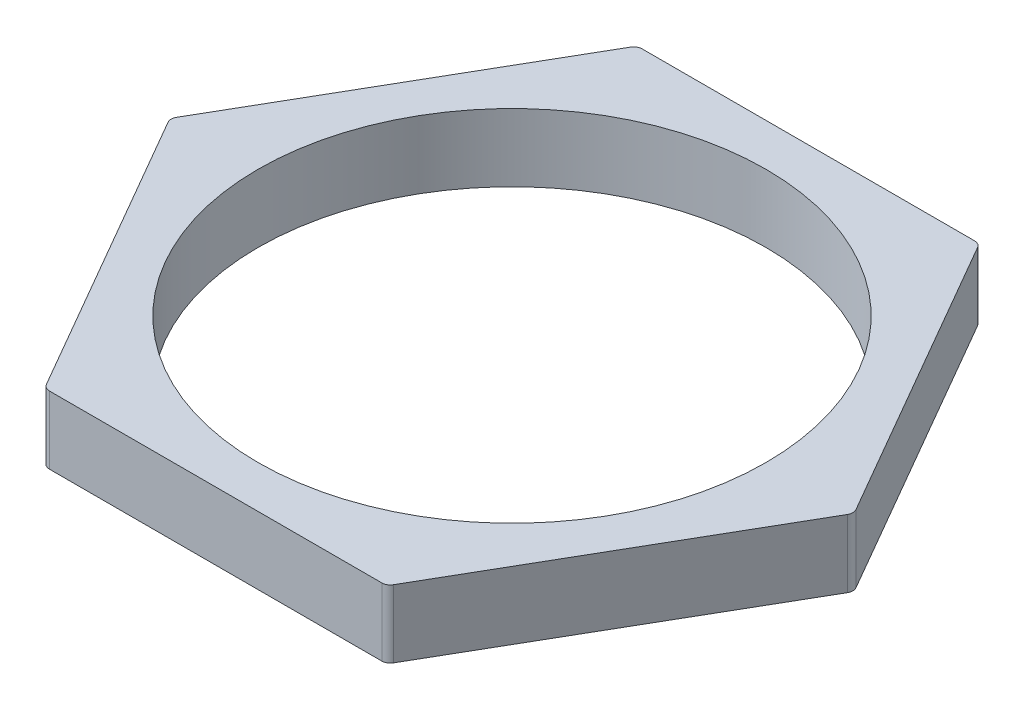
ISO-10303-21;
HEADER;
FILE_DESCRIPTION(('STEP AP214'),'2;1');
FILE_NAME('part.step','',(''),(''),'','','');
FILE_SCHEMA(('AUTOMOTIVE_DESIGN { 1 0 10303 214 1 1 1 1 }'));
ENDSEC;
DATA;
#1=APPLICATION_CONTEXT('core data for automotive mechanical design processes');
#2=APPLICATION_PROTOCOL_DEFINITION('international standard','automotive_design',2000,#1);
#3=PRODUCT_CONTEXT('',#1,'mechanical');
#4=PRODUCT('Part','Part','',(#3));
#5=PRODUCT_RELATED_PRODUCT_CATEGORY('part','',(#4));
#6=PRODUCT_DEFINITION_FORMATION('','',#4);
#7=PRODUCT_DEFINITION_CONTEXT('part definition',#1,'design');
#8=PRODUCT_DEFINITION('design','',#6,#7);
#9=PRODUCT_DEFINITION_SHAPE('','',#8);
#10=(LENGTH_UNIT() NAMED_UNIT(*) SI_UNIT(.MILLI.,.METRE.));
#11=(NAMED_UNIT(*) PLANE_ANGLE_UNIT() SI_UNIT($,.RADIAN.));
#12=(NAMED_UNIT(*) SI_UNIT($,.STERADIAN.) SOLID_ANGLE_UNIT());
#13=UNCERTAINTY_MEASURE_WITH_UNIT(LENGTH_MEASURE(1.E-05),#10,'distance_accuracy_value','');
#14=(GEOMETRIC_REPRESENTATION_CONTEXT(3) GLOBAL_UNCERTAINTY_ASSIGNED_CONTEXT((#13)) GLOBAL_UNIT_ASSIGNED_CONTEXT((#10,
#11,#12)) REPRESENTATION_CONTEXT('',''));
#15=CARTESIAN_POINT('',(0.,0.,0.));
#16=DIRECTION('',(0.,0.,1.));
#17=DIRECTION('',(1.,0.,0.));
#18=AXIS2_PLACEMENT_3D('',#15,#16,#17);
#19=CARTESIAN_POINT('',(9.81495457622365,4.,17.));
#20=DIRECTION('',(0.,-1.,0.));
#21=DIRECTION('',(0.,0.,-1.));
#22=AXIS2_PLACEMENT_3D('',#19,#20,#21);
#23=CYLINDRICAL_SURFACE('',#22,0.5);
#24=CARTESIAN_POINT('',(9.81495457622365,0.,17.));
#25=DIRECTION('',(0.,-1.,0.));
#26=DIRECTION('',(0.,0.,-1.));
#27=AXIS2_PLACEMENT_3D('',#24,#25,#26);
#28=CIRCLE('',#27,0.5);
#29=CARTESIAN_POINT('',(9.81495457622365,0.,17.5));
#30=VERTEX_POINT('',#29);
#31=CARTESIAN_POINT('',(10.2479672781159,0.,17.25));
#32=VERTEX_POINT('',#31);
#33=EDGE_CURVE('E20',#30,#32,#28,.F.);
#34=ORIENTED_EDGE('',*,*,#33,.T.);
#35=DIRECTION('',(0.,1.,0.));
#36=VECTOR('',#35,1.);
#37=CARTESIAN_POINT('',(10.2479672781159,4.,17.25));
#38=LINE('',#37,#36);
#39=CARTESIAN_POINT('',(10.2479672781159,4.,17.25));
#40=VERTEX_POINT('',#39);
#41=EDGE_CURVE('E76',#32,#40,#38,.T.);
#42=ORIENTED_EDGE('',*,*,#41,.T.);
#43=CARTESIAN_POINT('',(9.81495457622365,4.,17.));
#44=DIRECTION('',(0.,-1.,0.));
#45=DIRECTION('',(0.,0.,-1.));
#46=AXIS2_PLACEMENT_3D('',#43,#44,#45);
#47=CIRCLE('',#46,0.5);
#48=CARTESIAN_POINT('',(9.81495457622365,4.,17.5));
#49=VERTEX_POINT('',#48);
#50=EDGE_CURVE('E158',#49,#40,#47,.F.);
#51=ORIENTED_EDGE('',*,*,#50,.F.);
#52=DIRECTION('',(0.,1.,0.));
#53=VECTOR('',#52,1.);
#54=CARTESIAN_POINT('',(9.81495457622365,4.,17.5));
#55=LINE('',#54,#53);
#56=EDGE_CURVE('E78',#49,#30,#55,.F.);
#57=ORIENTED_EDGE('',*,*,#56,.T.);
#58=EDGE_LOOP('',(#34,#42,#51,#57));
#59=FACE_BOUND('',#58,.T.);
#60=ADVANCED_FACE('F17',(#59),#23,.T.);
#61=CARTESIAN_POINT('',(19.6299091524473,4.,0.));
#62=DIRECTION('',(0.,-1.,0.));
#63=DIRECTION('',(0.,0.,-1.));
#64=AXIS2_PLACEMENT_3D('',#61,#62,#63);
#65=CYLINDRICAL_SURFACE('',#64,0.5);
#66=CARTESIAN_POINT('',(19.6299091524473,0.,0.));
#67=DIRECTION('',(0.,-1.,0.));
#68=DIRECTION('',(0.,0.,-1.));
#69=AXIS2_PLACEMENT_3D('',#66,#67,#68);
#70=CIRCLE('',#69,0.5);
#71=CARTESIAN_POINT('',(20.0629218543395,0.,0.249999999999997));
#72=VERTEX_POINT('',#71);
#73=CARTESIAN_POINT('',(20.0629218543395,0.,-0.250000000000002));
#74=VERTEX_POINT('',#73);
#75=EDGE_CURVE('E80',#72,#74,#70,.F.);
#76=ORIENTED_EDGE('',*,*,#75,.T.);
#77=DIRECTION('',(0.,1.,0.));
#78=VECTOR('',#77,1.);
#79=CARTESIAN_POINT('',(20.0629218543395,4.,-0.250000000000004));
#80=LINE('',#79,#78);
#81=CARTESIAN_POINT('',(20.0629218543395,4.,-0.250000000000003));
#82=VERTEX_POINT('',#81);
#83=EDGE_CURVE('E124',#74,#82,#80,.T.);
#84=ORIENTED_EDGE('',*,*,#83,.T.);
#85=CARTESIAN_POINT('',(19.6299091524473,4.,0.));
#86=DIRECTION('',(0.,-1.,0.));
#87=DIRECTION('',(0.,0.,-1.));
#88=AXIS2_PLACEMENT_3D('',#85,#86,#87);
#89=CIRCLE('',#88,0.5);
#90=CARTESIAN_POINT('',(20.0629218543395,4.,0.249999999999997));
#91=VERTEX_POINT('',#90);
#92=EDGE_CURVE('E155',#91,#82,#89,.F.);
#93=ORIENTED_EDGE('',*,*,#92,.F.);
#94=DIRECTION('',(0.,1.,0.));
#95=VECTOR('',#94,1.);
#96=CARTESIAN_POINT('',(20.0629218543395,4.,0.249999999999997));
#97=LINE('',#96,#95);
#98=EDGE_CURVE('E89',#91,#72,#97,.F.);
#99=ORIENTED_EDGE('',*,*,#98,.T.);
#100=EDGE_LOOP('',(#76,#84,#93,#99));
#101=FACE_BOUND('',#100,.T.);
#102=ADVANCED_FACE('F175',(#101),#65,.T.);
#103=CARTESIAN_POINT('',(9.81495457622364,4.,-17.));
#104=DIRECTION('',(0.,-1.,0.));
#105=DIRECTION('',(0.,0.,-1.));
#106=AXIS2_PLACEMENT_3D('',#103,#104,#105);
#107=CYLINDRICAL_SURFACE('',#106,0.5);
#108=CARTESIAN_POINT('',(9.81495457622364,0.,-17.));
#109=DIRECTION('',(0.,-1.,0.));
#110=DIRECTION('',(0.,0.,-1.));
#111=AXIS2_PLACEMENT_3D('',#108,#109,#110);
#112=CIRCLE('',#111,0.5);
#113=CARTESIAN_POINT('',(10.2479672781159,0.,-17.25));
#114=VERTEX_POINT('',#113);
#115=CARTESIAN_POINT('',(9.81495457622364,0.,-17.5));
#116=VERTEX_POINT('',#115);
#117=EDGE_CURVE('E172',#114,#116,#112,.F.);
#118=ORIENTED_EDGE('',*,*,#117,.T.);
#119=DIRECTION('',(0.,1.,0.));
#120=VECTOR('',#119,1.);
#121=CARTESIAN_POINT('',(9.81495457622364,4.,-17.5));
#122=LINE('',#121,#120);
#123=CARTESIAN_POINT('',(9.81495457622364,4.,-17.5));
#124=VERTEX_POINT('',#123);
#125=EDGE_CURVE('E117',#116,#124,#122,.T.);
#126=ORIENTED_EDGE('',*,*,#125,.T.);
#127=CARTESIAN_POINT('',(9.81495457622364,4.,-17.));
#128=DIRECTION('',(0.,-1.,0.));
#129=DIRECTION('',(0.,0.,-1.));
#130=AXIS2_PLACEMENT_3D('',#127,#128,#129);
#131=CIRCLE('',#130,0.5);
#132=CARTESIAN_POINT('',(10.2479672781159,4.,-17.25));
#133=VERTEX_POINT('',#132);
#134=EDGE_CURVE('E152',#133,#124,#131,.F.);
#135=ORIENTED_EDGE('',*,*,#134,.F.);
#136=DIRECTION('',(0.,1.,0.));
#137=VECTOR('',#136,1.);
#138=CARTESIAN_POINT('',(10.2479672781159,4.,-17.25));
#139=LINE('',#138,#137);
#140=EDGE_CURVE('E127',#133,#114,#139,.F.);
#141=ORIENTED_EDGE('',*,*,#140,.T.);
#142=EDGE_LOOP('',(#118,#126,#135,#141));
#143=FACE_BOUND('',#142,.T.);
#144=ADVANCED_FACE('F187',(#143),#107,.T.);
#145=CARTESIAN_POINT('',(-9.81495457622364,4.,-17.));
#146=DIRECTION('',(0.,-1.,0.));
#147=DIRECTION('',(0.,0.,-1.));
#148=AXIS2_PLACEMENT_3D('',#145,#146,#147);
#149=CYLINDRICAL_SURFACE('',#148,0.5);
#150=CARTESIAN_POINT('',(-9.81495457622364,0.,-17.));
#151=DIRECTION('',(0.,-1.,0.));
#152=DIRECTION('',(0.,0.,-1.));
#153=AXIS2_PLACEMENT_3D('',#150,#151,#152);
#154=CIRCLE('',#153,0.5);
#155=CARTESIAN_POINT('',(-9.81495457622364,0.,-17.5));
#156=VERTEX_POINT('',#155);
#157=CARTESIAN_POINT('',(-10.2479672781159,0.,-17.25));
#158=VERTEX_POINT('',#157);
#159=EDGE_CURVE('E170',#156,#158,#154,.F.);
#160=ORIENTED_EDGE('',*,*,#159,.T.);
#161=DIRECTION('',(0.,1.,0.));
#162=VECTOR('',#161,1.);
#163=CARTESIAN_POINT('',(-10.2479672781159,4.,-17.25));
#164=LINE('',#163,#162);
#165=CARTESIAN_POINT('',(-10.2479672781159,4.,-17.25));
#166=VERTEX_POINT('',#165);
#167=EDGE_CURVE('E111',#158,#166,#164,.T.);
#168=ORIENTED_EDGE('',*,*,#167,.T.);
#169=CARTESIAN_POINT('',(-9.81495457622364,4.,-17.));
#170=DIRECTION('',(0.,-1.,0.));
#171=DIRECTION('',(0.,0.,-1.));
#172=AXIS2_PLACEMENT_3D('',#169,#170,#171);
#173=CIRCLE('',#172,0.5);
#174=CARTESIAN_POINT('',(-9.81495457622364,4.,-17.5));
#175=VERTEX_POINT('',#174);
#176=EDGE_CURVE('E136',#175,#166,#173,.F.);
#177=ORIENTED_EDGE('',*,*,#176,.F.);
#178=DIRECTION('',(0.,1.,0.));
#179=VECTOR('',#178,1.);
#180=CARTESIAN_POINT('',(-9.81495457622364,4.,-17.5));
#181=LINE('',#180,#179);
#182=EDGE_CURVE('E115',#175,#156,#181,.F.);
#183=ORIENTED_EDGE('',*,*,#182,.T.);
#184=EDGE_LOOP('',(#160,#168,#177,#183));
#185=FACE_BOUND('',#184,.T.);
#186=ADVANCED_FACE('F232',(#185),#149,.T.);
#187=CARTESIAN_POINT('',(-9.81495457622363,4.,17.));
#188=DIRECTION('',(0.,-1.,0.));
#189=DIRECTION('',(0.,0.,-1.));
#190=AXIS2_PLACEMENT_3D('',#187,#188,#189);
#191=CYLINDRICAL_SURFACE('',#190,0.5);
#192=CARTESIAN_POINT('',(-9.81495457622363,0.,17.));
#193=DIRECTION('',(0.,-1.,0.));
#194=DIRECTION('',(0.,0.,-1.));
#195=AXIS2_PLACEMENT_3D('',#192,#193,#194);
#196=CIRCLE('',#195,0.5);
#197=CARTESIAN_POINT('',(-10.2479672781158,0.,17.25));
#198=VERTEX_POINT('',#197);
#199=CARTESIAN_POINT('',(-9.81495457622363,0.,17.5));
#200=VERTEX_POINT('',#199);
#201=EDGE_CURVE('E168',#198,#200,#196,.F.);
#202=ORIENTED_EDGE('',*,*,#201,.T.);
#203=DIRECTION('',(0.,1.,0.));
#204=VECTOR('',#203,1.);
#205=CARTESIAN_POINT('',(-9.81495457622363,4.,17.5));
#206=LINE('',#205,#204);
#207=CARTESIAN_POINT('',(-9.81495457622363,4.,17.5));
#208=VERTEX_POINT('',#207);
#209=EDGE_CURVE('E132',#200,#208,#206,.T.);
#210=ORIENTED_EDGE('',*,*,#209,.T.);
#211=CARTESIAN_POINT('',(-9.81495457622363,4.,17.));
#212=DIRECTION('',(0.,-1.,0.));
#213=DIRECTION('',(0.,0.,-1.));
#214=AXIS2_PLACEMENT_3D('',#211,#212,#213);
#215=CIRCLE('',#214,0.5);
#216=CARTESIAN_POINT('',(-10.2479672781158,4.,17.25));
#217=VERTEX_POINT('',#216);
#218=EDGE_CURVE('E161',#217,#208,#215,.F.);
#219=ORIENTED_EDGE('',*,*,#218,.F.);
#220=DIRECTION('',(0.,1.,0.));
#221=VECTOR('',#220,1.);
#222=CARTESIAN_POINT('',(-10.2479672781158,4.,17.25));
#223=LINE('',#222,#221);
#224=EDGE_CURVE('E107',#217,#198,#223,.F.);
#225=ORIENTED_EDGE('',*,*,#224,.T.);
#226=EDGE_LOOP('',(#202,#210,#219,#225));
#227=FACE_BOUND('',#226,.T.);
#228=ADVANCED_FACE('F222',(#227),#191,.T.);
#229=CARTESIAN_POINT('',(-19.6299091524473,4.,0.));
#230=DIRECTION('',(0.,-1.,0.));
#231=DIRECTION('',(0.,0.,-1.));
#232=AXIS2_PLACEMENT_3D('',#229,#230,#231);
#233=CYLINDRICAL_SURFACE('',#232,0.5);
#234=CARTESIAN_POINT('',(-19.6299091524473,0.,0.));
#235=DIRECTION('',(0.,-1.,0.));
#236=DIRECTION('',(0.,0.,-1.));
#237=AXIS2_PLACEMENT_3D('',#234,#235,#236);
#238=CIRCLE('',#237,0.5);
#239=CARTESIAN_POINT('',(-20.0629218543395,0.,-0.249999999999987));
#240=VERTEX_POINT('',#239);
#241=CARTESIAN_POINT('',(-20.0629218543395,0.,0.250000000000013));
#242=VERTEX_POINT('',#241);
#243=EDGE_CURVE('E35',#240,#242,#238,.F.);
#244=ORIENTED_EDGE('',*,*,#243,.T.);
#245=DIRECTION('',(0.,1.,0.));
#246=VECTOR('',#245,1.);
#247=CARTESIAN_POINT('',(-20.0629218543395,4.,0.250000000000013));
#248=LINE('',#247,#246);
#249=CARTESIAN_POINT('',(-20.0629218543395,4.,0.250000000000013));
#250=VERTEX_POINT('',#249);
#251=EDGE_CURVE('E104',#242,#250,#248,.T.);
#252=ORIENTED_EDGE('',*,*,#251,.T.);
#253=CARTESIAN_POINT('',(-19.6299091524473,4.,0.));
#254=DIRECTION('',(0.,-1.,0.));
#255=DIRECTION('',(0.,0.,-1.));
#256=AXIS2_PLACEMENT_3D('',#253,#254,#255);
#257=CIRCLE('',#256,0.5);
#258=CARTESIAN_POINT('',(-20.0629218543395,4.,-0.249999999999986));
#259=VERTEX_POINT('',#258);
#260=EDGE_CURVE('E164',#259,#250,#257,.F.);
#261=ORIENTED_EDGE('',*,*,#260,.F.);
#262=DIRECTION('',(0.,1.,0.));
#263=VECTOR('',#262,1.);
#264=CARTESIAN_POINT('',(-20.0629218543395,4.,-0.249999999999986));
#265=LINE('',#264,#263);
#266=EDGE_CURVE('E110',#259,#240,#265,.F.);
#267=ORIENTED_EDGE('',*,*,#266,.T.);
#268=EDGE_LOOP('',(#244,#252,#261,#267));
#269=FACE_BOUND('',#268,.T.);
#270=ADVANCED_FACE('F220',(#269),#233,.T.);
#271=CARTESIAN_POINT('',(0.,4.,0.));
#272=DIRECTION('',(0.,1.,0.));
#273=DIRECTION('',(0.,0.,1.));
#274=AXIS2_PLACEMENT_3D('',#271,#272,#273);
#275=PLANE('',#274);
#276=CARTESIAN_POINT('',(0.,4.,0.));
#277=DIRECTION('',(0.,-1.,0.));
#278=DIRECTION('',(0.,0.,-1.));
#279=AXIS2_PLACEMENT_3D('',#276,#277,#278);
#280=CIRCLE('',#279,15.);
#281=CARTESIAN_POINT('',(0.,4.,-15.));
#282=VERTEX_POINT('',#281);
#283=EDGE_CURVE('E100',#282,#282,#280,.T.);
#284=ORIENTED_EDGE('',*,*,#283,.T.);
#285=EDGE_LOOP('',(#284));
#286=FACE_BOUND('',#285,.T.);
#287=DIRECTION('',(1.,0.,0.));
#288=VECTOR('',#287,1.);
#289=CARTESIAN_POINT('',(10.1036297108185,4.,-17.5));
#290=LINE('',#289,#288);
#291=EDGE_CURVE('E120',#124,#175,#290,.F.);
#292=ORIENTED_EDGE('',*,*,#291,.T.);
#293=ORIENTED_EDGE('',*,*,#176,.T.);
#294=DIRECTION('',(0.5,0.,-0.866025403784439));
#295=VECTOR('',#294,1.);
#296=CARTESIAN_POINT('',(-10.1036297108185,4.,-17.5));
#297=LINE('',#296,#295);
#298=EDGE_CURVE('E114',#166,#259,#297,.F.);
#299=ORIENTED_EDGE('',*,*,#298,.T.);
#300=ORIENTED_EDGE('',*,*,#260,.T.);
#301=DIRECTION('',(-0.5,0.,-0.866025403784438));
#302=VECTOR('',#301,1.);
#303=CARTESIAN_POINT('',(-20.2072594216369,4.,0.));
#304=LINE('',#303,#302);
#305=EDGE_CURVE('E106',#250,#217,#304,.F.);
#306=ORIENTED_EDGE('',*,*,#305,.T.);
#307=ORIENTED_EDGE('',*,*,#218,.T.);
#308=DIRECTION('',(-1.,0.,0.));
#309=VECTOR('',#308,1.);
#310=CARTESIAN_POINT('',(-10.1036297108184,4.,17.5));
#311=LINE('',#310,#309);
#312=EDGE_CURVE('E131',#208,#49,#311,.F.);
#313=ORIENTED_EDGE('',*,*,#312,.T.);
#314=ORIENTED_EDGE('',*,*,#50,.T.);
#315=DIRECTION('',(-0.5,0.,0.866025403784439));
#316=VECTOR('',#315,1.);
#317=CARTESIAN_POINT('',(10.1036297108185,4.,17.5));
#318=LINE('',#317,#316);
#319=EDGE_CURVE('E88',#40,#91,#318,.F.);
#320=ORIENTED_EDGE('',*,*,#319,.T.);
#321=ORIENTED_EDGE('',*,*,#92,.T.);
#322=DIRECTION('',(0.5,0.,0.866025403784439));
#323=VECTOR('',#322,1.);
#324=CARTESIAN_POINT('',(20.2072594216369,4.,0.));
#325=LINE('',#324,#323);
#326=EDGE_CURVE('E121',#82,#133,#325,.F.);
#327=ORIENTED_EDGE('',*,*,#326,.T.);
#328=ORIENTED_EDGE('',*,*,#134,.T.);
#329=EDGE_LOOP('',(#292,#293,#299,#300,#306,#307,#313,#314,#320,#321,#327,#328));
#330=FACE_BOUND('',#329,.T.);
#331=ADVANCED_FACE('F212',(#286,#330),#275,.T.);
#332=CARTESIAN_POINT('',(-10.1036297108184,4.,17.5));
#333=DIRECTION('',(0.,0.,-1.));
#334=DIRECTION('',(-1.,0.,0.));
#335=AXIS2_PLACEMENT_3D('',#332,#333,#334);
#336=PLANE('',#335);
#337=ORIENTED_EDGE('',*,*,#209,.F.);
#338=DIRECTION('',(1.,0.,0.));
#339=VECTOR('',#338,1.);
#340=CARTESIAN_POINT('',(0.,0.,17.5));
#341=LINE('',#340,#339);
#342=EDGE_CURVE('E95',#200,#30,#341,.T.);
#343=ORIENTED_EDGE('',*,*,#342,.T.);
#344=ORIENTED_EDGE('',*,*,#56,.F.);
#345=ORIENTED_EDGE('',*,*,#312,.F.);
#346=EDGE_LOOP('',(#337,#343,#344,#345));
#347=FACE_BOUND('',#346,.T.);
#348=ADVANCED_FACE('F229',(#347),#336,.F.);
#349=CARTESIAN_POINT('',(10.1036297108185,4.,17.5));
#350=DIRECTION('',(-0.866025403784439,0.,-0.5));
#351=DIRECTION('',(-0.5,0.,0.866025403784439));
#352=AXIS2_PLACEMENT_3D('',#349,#350,#351);
#353=PLANE('',#352);
#354=ORIENTED_EDGE('',*,*,#41,.F.);
#355=DIRECTION('',(0.5,0.,-0.866025403784439));
#356=VECTOR('',#355,1.);
#357=CARTESIAN_POINT('',(10.2479672781159,0.,17.25));
#358=LINE('',#357,#356);
#359=EDGE_CURVE('E86',#32,#72,#358,.T.);
#360=ORIENTED_EDGE('',*,*,#359,.T.);
#361=ORIENTED_EDGE('',*,*,#98,.F.);
#362=ORIENTED_EDGE('',*,*,#319,.F.);
#363=EDGE_LOOP('',(#354,#360,#361,#362));
#364=FACE_BOUND('',#363,.T.);
#365=ADVANCED_FACE('F84',(#364),#353,.F.);
#366=CARTESIAN_POINT('',(20.2072594216369,4.,0.));
#367=DIRECTION('',(-0.866025403784439,0.,0.5));
#368=DIRECTION('',(0.5,0.,0.866025403784439));
#369=AXIS2_PLACEMENT_3D('',#366,#367,#368);
#370=PLANE('',#369);
#371=ORIENTED_EDGE('',*,*,#83,.F.);
#372=DIRECTION('',(-0.5,0.,-0.866025403784438));
#373=VECTOR('',#372,1.);
#374=CARTESIAN_POINT('',(20.0629218543395,0.,-0.250000000000002));
#375=LINE('',#374,#373);
#376=EDGE_CURVE('E94',#74,#114,#375,.T.);
#377=ORIENTED_EDGE('',*,*,#376,.T.);
#378=ORIENTED_EDGE('',*,*,#140,.F.);
#379=ORIENTED_EDGE('',*,*,#326,.F.);
#380=EDGE_LOOP('',(#371,#377,#378,#379));
#381=FACE_BOUND('',#380,.T.);
#382=ADVANCED_FACE('F180',(#381),#370,.F.);
#383=CARTESIAN_POINT('',(10.1036297108185,4.,-17.5));
#384=DIRECTION('',(0.,0.,1.));
#385=DIRECTION('',(1.,0.,0.));
#386=AXIS2_PLACEMENT_3D('',#383,#384,#385);
#387=PLANE('',#386);
#388=ORIENTED_EDGE('',*,*,#182,.F.);
#389=ORIENTED_EDGE('',*,*,#291,.F.);
#390=ORIENTED_EDGE('',*,*,#125,.F.);
#391=DIRECTION('',(1.,0.,0.));
#392=VECTOR('',#391,1.);
#393=CARTESIAN_POINT('',(0.,0.,-17.5));
#394=LINE('',#393,#392);
#395=EDGE_CURVE('E98',#116,#156,#394,.F.);
#396=ORIENTED_EDGE('',*,*,#395,.T.);
#397=EDGE_LOOP('',(#388,#389,#390,#396));
#398=FACE_BOUND('',#397,.T.);
#399=ADVANCED_FACE('F251',(#398),#387,.F.);
#400=CARTESIAN_POINT('',(-10.1036297108185,4.,-17.5));
#401=DIRECTION('',(0.866025403784439,0.,0.5));
#402=DIRECTION('',(0.5,0.,-0.866025403784439));
#403=AXIS2_PLACEMENT_3D('',#400,#401,#402);
#404=PLANE('',#403);
#405=ORIENTED_EDGE('',*,*,#266,.F.);
#406=ORIENTED_EDGE('',*,*,#298,.F.);
#407=ORIENTED_EDGE('',*,*,#167,.F.);
#408=DIRECTION('',(-0.5,0.,0.866025403784439));
#409=VECTOR('',#408,1.);
#410=CARTESIAN_POINT('',(-10.2479672781159,0.,-17.25));
#411=LINE('',#410,#409);
#412=EDGE_CURVE('E266',#158,#240,#411,.T.);
#413=ORIENTED_EDGE('',*,*,#412,.T.);
#414=EDGE_LOOP('',(#405,#406,#407,#413));
#415=FACE_BOUND('',#414,.T.);
#416=ADVANCED_FACE('F248',(#415),#404,.F.);
#417=CARTESIAN_POINT('',(-20.2072594216369,4.,0.));
#418=DIRECTION('',(0.866025403784438,0.,-0.5));
#419=DIRECTION('',(-0.5,0.,-0.866025403784438));
#420=AXIS2_PLACEMENT_3D('',#417,#418,#419);
#421=PLANE('',#420);
#422=ORIENTED_EDGE('',*,*,#251,.F.);
#423=DIRECTION('',(0.5,0.,0.866025403784438));
#424=VECTOR('',#423,1.);
#425=CARTESIAN_POINT('',(-20.0629218543395,0.,0.250000000000013));
#426=LINE('',#425,#424);
#427=EDGE_CURVE('E26',#242,#198,#426,.T.);
#428=ORIENTED_EDGE('',*,*,#427,.T.);
#429=ORIENTED_EDGE('',*,*,#224,.F.);
#430=ORIENTED_EDGE('',*,*,#305,.F.);
#431=EDGE_LOOP('',(#422,#428,#429,#430));
#432=FACE_BOUND('',#431,.T.);
#433=ADVANCED_FACE('F216',(#432),#421,.F.);
#434=CARTESIAN_POINT('',(0.,4.,0.));
#435=DIRECTION('',(0.,-1.,0.));
#436=DIRECTION('',(0.,0.,-1.));
#437=AXIS2_PLACEMENT_3D('',#434,#435,#436);
#438=CYLINDRICAL_SURFACE('',#437,15.);
#439=CARTESIAN_POINT('',(0.,0.,0.));
#440=DIRECTION('',(0.,-1.,0.));
#441=DIRECTION('',(0.,0.,-1.));
#442=AXIS2_PLACEMENT_3D('',#439,#440,#441);
#443=CIRCLE('',#442,15.);
#444=CARTESIAN_POINT('',(0.,0.,-15.));
#445=VERTEX_POINT('',#444);
#446=EDGE_CURVE('E10',#445,#445,#443,.T.);
#447=ORIENTED_EDGE('',*,*,#446,.T.);
#448=EDGE_LOOP('',(#447));
#449=FACE_BOUND('',#448,.T.);
#450=ORIENTED_EDGE('',*,*,#283,.F.);
#451=EDGE_LOOP('',(#450));
#452=FACE_BOUND('',#451,.T.);
#453=ADVANCED_FACE('F236',(#449,#452),#438,.F.);
#454=CARTESIAN_POINT('',(0.,0.,0.));
#455=DIRECTION('',(0.,1.,0.));
#456=DIRECTION('',(0.,0.,1.));
#457=AXIS2_PLACEMENT_3D('',#454,#455,#456);
#458=PLANE('',#457);
#459=ORIENTED_EDGE('',*,*,#446,.F.);
#460=EDGE_LOOP('',(#459));
#461=FACE_BOUND('',#460,.T.);
#462=ORIENTED_EDGE('',*,*,#243,.F.);
#463=ORIENTED_EDGE('',*,*,#412,.F.);
#464=ORIENTED_EDGE('',*,*,#159,.F.);
#465=ORIENTED_EDGE('',*,*,#395,.F.);
#466=ORIENTED_EDGE('',*,*,#117,.F.);
#467=ORIENTED_EDGE('',*,*,#376,.F.);
#468=ORIENTED_EDGE('',*,*,#75,.F.);
#469=ORIENTED_EDGE('',*,*,#359,.F.);
#470=ORIENTED_EDGE('',*,*,#33,.F.);
#471=ORIENTED_EDGE('',*,*,#342,.F.);
#472=ORIENTED_EDGE('',*,*,#201,.F.);
#473=ORIENTED_EDGE('',*,*,#427,.F.);
#474=EDGE_LOOP('',(#462,#463,#464,#465,#466,#467,#468,#469,#470,#471,#472,#473));
#475=FACE_BOUND('',#474,.T.);
#476=ADVANCED_FACE('F91',(#461,#475),#458,.F.);
#477=CLOSED_SHELL('',(#60,#102,#144,#186,#228,#270,#331,#348,#365,#382,#399,#416,#433,#453,#476));
#478=MANIFOLD_SOLID_BREP('B1',#477);
#479=ADVANCED_BREP_SHAPE_REPRESENTATION('',(#18,#478),#14);
#480=SHAPE_DEFINITION_REPRESENTATION(#9,#479);
ENDSEC;
END-ISO-10303-21;
